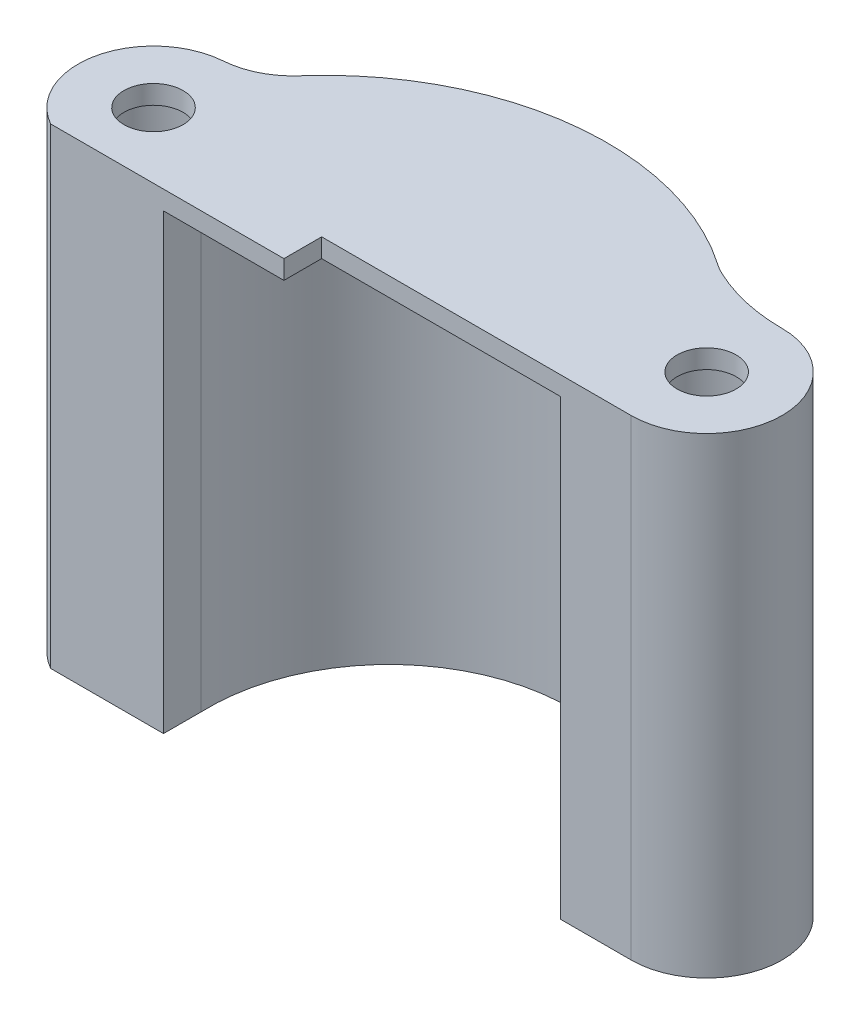
ISO-10303-21;
HEADER;
FILE_DESCRIPTION(('STEP AP214'),'2;1');
FILE_NAME('part.step','',(''),(''),'','','');
FILE_SCHEMA(('AUTOMOTIVE_DESIGN { 1 0 10303 214 1 1 1 1 }'));
ENDSEC;
DATA;
#1=APPLICATION_CONTEXT('core data for automotive mechanical design processes');
#2=APPLICATION_PROTOCOL_DEFINITION('international standard','automotive_design',2000,#1);
#3=PRODUCT_CONTEXT('',#1,'mechanical');
#4=PRODUCT('Part','Part','',(#3));
#5=PRODUCT_RELATED_PRODUCT_CATEGORY('part','',(#4));
#6=PRODUCT_DEFINITION_FORMATION('','',#4);
#7=PRODUCT_DEFINITION_CONTEXT('part definition',#1,'design');
#8=PRODUCT_DEFINITION('design','',#6,#7);
#9=PRODUCT_DEFINITION_SHAPE('','',#8);
#10=(LENGTH_UNIT() NAMED_UNIT(*) SI_UNIT(.MILLI.,.METRE.));
#11=(NAMED_UNIT(*) PLANE_ANGLE_UNIT() SI_UNIT($,.RADIAN.));
#12=(NAMED_UNIT(*) SI_UNIT($,.STERADIAN.) SOLID_ANGLE_UNIT());
#13=UNCERTAINTY_MEASURE_WITH_UNIT(LENGTH_MEASURE(1.E-05),#10,'distance_accuracy_value','');
#14=(GEOMETRIC_REPRESENTATION_CONTEXT(3) GLOBAL_UNCERTAINTY_ASSIGNED_CONTEXT((#13)) GLOBAL_UNIT_ASSIGNED_CONTEXT((#10,
#11,#12)) REPRESENTATION_CONTEXT('',''));
#15=CARTESIAN_POINT('',(0.,0.,0.));
#16=DIRECTION('',(0.,0.,1.));
#17=DIRECTION('',(1.,0.,0.));
#18=AXIS2_PLACEMENT_3D('',#15,#16,#17);
#19=CARTESIAN_POINT('',(-13.6378226737925,38.1,0.));
#20=DIRECTION('',(-1.,0.,0.));
#21=DIRECTION('',(0.,0.,1.));
#22=AXIS2_PLACEMENT_3D('',#19,#20,#21);
#23=PLANE('',#22);
#24=DIRECTION('',(0.,0.,1.));
#25=VECTOR('',#24,1.);
#26=CARTESIAN_POINT('',(-13.6378226737925,38.1,0.));
#27=LINE('',#26,#25);
#28=CARTESIAN_POINT('',(-13.6378226737925,38.1,15.7404965999173));
#29=VERTEX_POINT('',#28);
#30=CARTESIAN_POINT('',(-13.6378226737925,38.1,18.9154965999173));
#31=VERTEX_POINT('',#30);
#32=EDGE_CURVE('E139',#29,#31,#27,.T.);
#33=ORIENTED_EDGE('',*,*,#32,.T.);
#34=DIRECTION('',(0.,-1.,0.));
#35=VECTOR('',#34,1.);
#36=CARTESIAN_POINT('',(-13.6378226737925,38.1,18.9154965999173));
#37=LINE('',#36,#35);
#38=CARTESIAN_POINT('',(-13.6378226737925,0.,18.9154965999173));
#39=VERTEX_POINT('',#38);
#40=EDGE_CURVE('E151',#31,#39,#37,.T.);
#41=ORIENTED_EDGE('',*,*,#40,.T.);
#42=DIRECTION('',(0.,0.,-1.));
#43=VECTOR('',#42,1.);
#44=CARTESIAN_POINT('',(-13.6378226737925,0.,0.));
#45=LINE('',#44,#43);
#46=CARTESIAN_POINT('',(-13.6378226737925,0.,15.7404965999173));
#47=VERTEX_POINT('',#46);
#48=EDGE_CURVE('E245',#39,#47,#45,.T.);
#49=ORIENTED_EDGE('',*,*,#48,.T.);
#50=DIRECTION('',(0.,-1.,0.));
#51=VECTOR('',#50,1.);
#52=CARTESIAN_POINT('',(-13.6378226737925,38.1,15.7404965999173));
#53=LINE('',#52,#51);
#54=EDGE_CURVE('E154',#29,#47,#53,.T.);
#55=ORIENTED_EDGE('',*,*,#54,.F.);
#56=EDGE_LOOP('',(#33,#41,#49,#55));
#57=FACE_BOUND('',#56,.T.);
#58=ADVANCED_FACE('F40',(#57),#23,.F.);
#59=CARTESIAN_POINT('',(0.,38.1,15.7404965999173));
#60=DIRECTION('',(0.,0.,-1.));
#61=DIRECTION('',(-1.,0.,0.));
#62=AXIS2_PLACEMENT_3D('',#59,#60,#61);
#63=PLANE('',#62);
#64=DIRECTION('',(0.,1.,0.));
#65=VECTOR('',#64,1.);
#66=CARTESIAN_POINT('',(-3.50380748671772,17.7380475663924,15.7404965999173));
#67=LINE('',#66,#65);
#68=CARTESIAN_POINT('',(-3.50380748671772,38.1,15.7404965999173));
#69=VERTEX_POINT('',#68);
#70=CARTESIAN_POINT('',(-3.50380748671772,39.6875,15.7404965999173));
#71=VERTEX_POINT('',#70);
#72=EDGE_CURVE('E331',#69,#71,#67,.T.);
#73=ORIENTED_EDGE('',*,*,#72,.F.);
#74=DIRECTION('',(1.,0.,0.));
#75=VECTOR('',#74,1.);
#76=CARTESIAN_POINT('',(-13.6378226737925,38.1,15.7404965999173));
#77=LINE('',#76,#75);
#78=CARTESIAN_POINT('',(16.6090859378619,38.1,15.7404965999173));
#79=VERTEX_POINT('',#78);
#80=EDGE_CURVE('E225',#69,#79,#77,.T.);
#81=ORIENTED_EDGE('',*,*,#80,.T.);
#82=DIRECTION('',(0.,-1.,0.));
#83=VECTOR('',#82,1.);
#84=CARTESIAN_POINT('',(16.6090859378619,38.1,15.7404965999173));
#85=LINE('',#84,#83);
#86=CARTESIAN_POINT('',(16.6090859378619,0.,15.7404965999173));
#87=VERTEX_POINT('',#86);
#88=EDGE_CURVE('E279',#79,#87,#85,.T.);
#89=ORIENTED_EDGE('',*,*,#88,.T.);
#90=DIRECTION('',(1.,0.,0.));
#91=VECTOR('',#90,1.);
#92=CARTESIAN_POINT('',(0.,0.,15.7404965999173));
#93=LINE('',#92,#91);
#94=CARTESIAN_POINT('',(22.5456913931761,0.,15.7404965999173));
#95=VERTEX_POINT('',#94);
#96=EDGE_CURVE('E255',#87,#95,#93,.T.);
#97=ORIENTED_EDGE('',*,*,#96,.T.);
#98=DIRECTION('',(0.,-1.,0.));
#99=VECTOR('',#98,1.);
#100=CARTESIAN_POINT('',(22.5456913931761,38.1,15.7404965999173));
#101=LINE('',#100,#99);
#102=CARTESIAN_POINT('',(22.5456913931761,39.6875,15.7404965999173));
#103=VERTEX_POINT('',#102);
#104=EDGE_CURVE('E275',#103,#95,#101,.T.);
#105=ORIENTED_EDGE('',*,*,#104,.F.);
#106=DIRECTION('',(1.,0.,0.));
#107=VECTOR('',#106,1.);
#108=CARTESIAN_POINT('',(16.6090859378619,39.6875,15.7404965999173));
#109=LINE('',#108,#107);
#110=EDGE_CURVE('E228',#71,#103,#109,.T.);
#111=ORIENTED_EDGE('',*,*,#110,.F.);
#112=EDGE_LOOP('',(#73,#81,#89,#97,#105,#111));
#113=FACE_BOUND('',#112,.T.);
#114=ADVANCED_FACE('F297',(#113),#63,.F.);
#115=CARTESIAN_POINT('',(16.6090859378619,38.1,0.));
#116=DIRECTION('',(1.,0.,0.));
#117=DIRECTION('',(0.,0.,-1.));
#118=AXIS2_PLACEMENT_3D('',#115,#116,#117);
#119=PLANE('',#118);
#120=DIRECTION('',(0.,0.,-1.));
#121=VECTOR('',#120,1.);
#122=CARTESIAN_POINT('',(16.6090859378619,38.1,0.));
#123=LINE('',#122,#121);
#124=CARTESIAN_POINT('',(16.6090859378619,38.1,12.5654965999173));
#125=VERTEX_POINT('',#124);
#126=EDGE_CURVE('E147',#79,#125,#123,.T.);
#127=ORIENTED_EDGE('',*,*,#126,.T.);
#128=DIRECTION('',(0.,-1.,0.));
#129=VECTOR('',#128,1.);
#130=CARTESIAN_POINT('',(16.6090859378619,38.1,12.5654965999173));
#131=LINE('',#130,#129);
#132=CARTESIAN_POINT('',(16.6090859378619,0.,12.5654965999173));
#133=VERTEX_POINT('',#132);
#134=EDGE_CURVE('E171',#125,#133,#131,.T.);
#135=ORIENTED_EDGE('',*,*,#134,.T.);
#136=DIRECTION('',(0.,0.,1.));
#137=VECTOR('',#136,1.);
#138=CARTESIAN_POINT('',(16.6090859378619,0.,0.));
#139=LINE('',#138,#137);
#140=EDGE_CURVE('E251',#133,#87,#139,.T.);
#141=ORIENTED_EDGE('',*,*,#140,.T.);
#142=ORIENTED_EDGE('',*,*,#88,.F.);
#143=EDGE_LOOP('',(#127,#135,#141,#142));
#144=FACE_BOUND('',#143,.T.);
#145=ADVANCED_FACE('F286',(#144),#119,.F.);
#146=CARTESIAN_POINT('',(1.66297527786936,38.1,20.6134230140809));
#147=DIRECTION('',(0.,-1.,0.));
#148=DIRECTION('',(0.,0.,-1.));
#149=AXIS2_PLACEMENT_3D('',#146,#147,#148);
#150=CYLINDRICAL_SURFACE('',#149,23.746023500555);
#151=CARTESIAN_POINT('',(1.66297527786936,39.6875,20.6134230140809));
#152=DIRECTION('',(0.,1.,0.));
#153=DIRECTION('',(0.,0.,1.));
#154=AXIS2_PLACEMENT_3D('',#151,#152,#153);
#155=CIRCLE('',#154,23.746023500555);
#156=CARTESIAN_POINT('',(15.1487765830653,39.6875,1.06842889165444));
#157=VERTEX_POINT('',#156);
#158=CARTESIAN_POINT('',(-16.1639042572107,39.6875,4.92661332789374));
#159=VERTEX_POINT('',#158);
#160=EDGE_CURVE('E215',#157,#159,#155,.T.);
#161=ORIENTED_EDGE('',*,*,#160,.F.);
#162=DIRECTION('',(0.,-1.,0.));
#163=VECTOR('',#162,1.);
#164=CARTESIAN_POINT('',(15.1487765830653,38.1,1.06842889165443));
#165=LINE('',#164,#163);
#166=CARTESIAN_POINT('',(15.1487765830653,0.,1.06842889165443));
#167=VERTEX_POINT('',#166);
#168=EDGE_CURVE('E177',#157,#167,#165,.T.);
#169=ORIENTED_EDGE('',*,*,#168,.T.);
#170=CARTESIAN_POINT('',(1.66297527786936,0.,20.6134230140809));
#171=DIRECTION('',(0.,1.,0.));
#172=DIRECTION('',(0.,0.,1.));
#173=AXIS2_PLACEMENT_3D('',#170,#171,#172);
#174=CIRCLE('',#173,23.746023500555);
#175=CARTESIAN_POINT('',(-16.1639042572107,0.,4.92661332789373));
#176=VERTEX_POINT('',#175);
#177=EDGE_CURVE('E199',#176,#167,#174,.F.);
#178=ORIENTED_EDGE('',*,*,#177,.F.);
#179=DIRECTION('',(0.,-1.,0.));
#180=VECTOR('',#179,1.);
#181=CARTESIAN_POINT('',(-16.1639042572107,38.1,4.92661332789373));
#182=LINE('',#181,#180);
#183=EDGE_CURVE('E169',#176,#159,#182,.F.);
#184=ORIENTED_EDGE('',*,*,#183,.T.);
#185=EDGE_LOOP('',(#161,#169,#178,#184));
#186=FACE_BOUND('',#185,.T.);
#187=ADVANCED_FACE('F203',(#186),#150,.T.);
#188=CARTESIAN_POINT('',(-19.9966884261341,38.1,13.3973356971205));
#189=DIRECTION('',(0.,-1.,0.));
#190=DIRECTION('',(0.,0.,-1.));
#191=AXIS2_PLACEMENT_3D('',#188,#189,#190);
#192=CYLINDRICAL_SURFACE('',#191,6.35);
#193=CARTESIAN_POINT('',(-19.9966884261341,39.6875,13.3973356971205));
#194=DIRECTION('',(0.,1.,0.));
#195=DIRECTION('',(0.,0.,1.));
#196=AXIS2_PLACEMENT_3D('',#193,#194,#195);
#197=CIRCLE('',#196,6.35);
#198=CARTESIAN_POINT('',(-20.4638677435349,39.6875,7.06454456797428));
#199=VERTEX_POINT('',#198);
#200=CARTESIAN_POINT('',(-23.1387260215241,39.6875,18.9154965999173));
#201=VERTEX_POINT('',#200);
#202=EDGE_CURVE('E211',#199,#201,#197,.T.);
#203=ORIENTED_EDGE('',*,*,#202,.F.);
#204=DIRECTION('',(0.,-1.,0.));
#205=VECTOR('',#204,1.);
#206=CARTESIAN_POINT('',(-20.4638677435349,38.1,7.06454456797428));
#207=LINE('',#206,#205);
#208=CARTESIAN_POINT('',(-20.4638677435349,0.,7.06454456797428));
#209=VERTEX_POINT('',#208);
#210=EDGE_CURVE('E184',#199,#209,#207,.T.);
#211=ORIENTED_EDGE('',*,*,#210,.T.);
#212=CARTESIAN_POINT('',(-19.9966884261341,0.,13.3973356971205));
#213=DIRECTION('',(0.,1.,0.));
#214=DIRECTION('',(0.,0.,1.));
#215=AXIS2_PLACEMENT_3D('',#212,#213,#214);
#216=CIRCLE('',#215,6.35);
#217=CARTESIAN_POINT('',(-23.1387260215241,0.,18.9154965999173));
#218=VERTEX_POINT('',#217);
#219=EDGE_CURVE('E200',#209,#218,#216,.T.);
#220=ORIENTED_EDGE('',*,*,#219,.T.);
#221=DIRECTION('',(0.,-1.,0.));
#222=VECTOR('',#221,1.);
#223=CARTESIAN_POINT('',(-23.1387260215241,38.1,18.9154965999173));
#224=LINE('',#223,#222);
#225=EDGE_CURVE('E165',#201,#218,#224,.T.);
#226=ORIENTED_EDGE('',*,*,#225,.F.);
#227=EDGE_LOOP('',(#203,#211,#220,#226));
#228=FACE_BOUND('',#227,.T.);
#229=ADVANCED_FACE('F209',(#228),#192,.T.);
#230=CARTESIAN_POINT('',(0.,38.1,18.9154965999173));
#231=DIRECTION('',(0.,0.,-1.));
#232=DIRECTION('',(-1.,0.,0.));
#233=AXIS2_PLACEMENT_3D('',#230,#231,#232);
#234=PLANE('',#233);
#235=DIRECTION('',(1.,0.,0.));
#236=VECTOR('',#235,1.);
#237=CARTESIAN_POINT('',(0.,0.,18.9154965999173));
#238=LINE('',#237,#236);
#239=EDGE_CURVE('E162',#218,#39,#238,.T.);
#240=ORIENTED_EDGE('',*,*,#239,.T.);
#241=ORIENTED_EDGE('',*,*,#40,.F.);
#242=DIRECTION('',(-1.,0.,0.));
#243=VECTOR('',#242,1.);
#244=CARTESIAN_POINT('',(0.,38.1,18.9154965999173));
#245=LINE('',#244,#243);
#246=CARTESIAN_POINT('',(-3.50380748671772,38.1,18.9154965999173));
#247=VERTEX_POINT('',#246);
#248=EDGE_CURVE('E134',#247,#31,#245,.T.);
#249=ORIENTED_EDGE('',*,*,#248,.F.);
#250=DIRECTION('',(0.,1.,0.));
#251=VECTOR('',#250,1.);
#252=CARTESIAN_POINT('',(-3.50380748671772,17.7380475663924,18.9154965999173));
#253=LINE('',#252,#251);
#254=CARTESIAN_POINT('',(-3.50380748671772,39.6875,18.9154965999173));
#255=VERTEX_POINT('',#254);
#256=EDGE_CURVE('E157',#247,#255,#253,.T.);
#257=ORIENTED_EDGE('',*,*,#256,.T.);
#258=DIRECTION('',(1.,0.,0.));
#259=VECTOR('',#258,1.);
#260=CARTESIAN_POINT('',(-23.1387260215241,39.6875,18.9154965999173));
#261=LINE('',#260,#259);
#262=EDGE_CURVE('E214',#201,#255,#261,.T.);
#263=ORIENTED_EDGE('',*,*,#262,.F.);
#264=ORIENTED_EDGE('',*,*,#225,.T.);
#265=EDGE_LOOP('',(#240,#241,#249,#257,#263,#264));
#266=FACE_BOUND('',#265,.T.);
#267=ADVANCED_FACE('F159',(#266),#234,.F.);
#268=CARTESIAN_POINT('',(1.59099250923585,38.1,15.1567259932861));
#269=DIRECTION('',(0.,-1.,0.));
#270=DIRECTION('',(0.,0.,-1.));
#271=AXIS2_PLACEMENT_3D('',#268,#269,#270);
#272=CYLINDRICAL_SURFACE('',#271,15.24);
#273=CARTESIAN_POINT('',(1.59099250923585,0.,15.1567259932861));
#274=DIRECTION('',(0.,1.,0.));
#275=DIRECTION('',(0.,0.,1.));
#276=AXIS2_PLACEMENT_3D('',#273,#274,#275);
#277=CIRCLE('',#276,15.24);
#278=EDGE_CURVE('E248',#47,#133,#277,.F.);
#279=ORIENTED_EDGE('',*,*,#278,.T.);
#280=ORIENTED_EDGE('',*,*,#134,.F.);
#281=CARTESIAN_POINT('',(1.59099250923585,38.1,15.1567259932861));
#282=DIRECTION('',(0.,1.,0.));
#283=DIRECTION('',(0.,0.,1.));
#284=AXIS2_PLACEMENT_3D('',#281,#282,#283);
#285=CIRCLE('',#284,15.24);
#286=EDGE_CURVE('E230',#29,#125,#285,.F.);
#287=ORIENTED_EDGE('',*,*,#286,.F.);
#288=ORIENTED_EDGE('',*,*,#54,.T.);
#289=EDGE_LOOP('',(#279,#280,#287,#288));
#290=FACE_BOUND('',#289,.T.);
#291=ADVANCED_FACE('F343',(#290),#272,.F.);
#292=CARTESIAN_POINT('',(22.545691393176,38.1,9.39049659991733));
#293=DIRECTION('',(0.,-1.,0.));
#294=DIRECTION('',(0.,0.,-1.));
#295=AXIS2_PLACEMENT_3D('',#292,#293,#294);
#296=CYLINDRICAL_SURFACE('',#295,6.35);
#297=CARTESIAN_POINT('',(22.545691393176,0.,9.39049659991733));
#298=DIRECTION('',(0.,1.,0.));
#299=DIRECTION('',(0.,0.,1.));
#300=AXIS2_PLACEMENT_3D('',#297,#298,#299);
#301=CIRCLE('',#300,6.35);
#302=CARTESIAN_POINT('',(22.545691393176,0.,3.04049659991733));
#303=VERTEX_POINT('',#302);
#304=EDGE_CURVE('E258',#95,#303,#301,.T.);
#305=ORIENTED_EDGE('',*,*,#304,.T.);
#306=DIRECTION('',(0.,-1.,0.));
#307=VECTOR('',#306,1.);
#308=CARTESIAN_POINT('',(22.545691393176,38.1,3.04049659991733));
#309=LINE('',#308,#307);
#310=CARTESIAN_POINT('',(22.545691393176,39.6875,3.04049659991733));
#311=VERTEX_POINT('',#310);
#312=EDGE_CURVE('E233',#311,#303,#309,.T.);
#313=ORIENTED_EDGE('',*,*,#312,.F.);
#314=CARTESIAN_POINT('',(22.545691393176,39.6875,9.39049659991733));
#315=DIRECTION('',(0.,1.,0.));
#316=DIRECTION('',(0.,0.,1.));
#317=AXIS2_PLACEMENT_3D('',#314,#315,#316);
#318=CIRCLE('',#317,6.35);
#319=EDGE_CURVE('E303',#103,#311,#318,.T.);
#320=ORIENTED_EDGE('',*,*,#319,.F.);
#321=ORIENTED_EDGE('',*,*,#104,.T.);
#322=EDGE_LOOP('',(#305,#313,#320,#321));
#323=FACE_BOUND('',#322,.T.);
#324=ADVANCED_FACE('F301',(#323),#296,.T.);
#325=CARTESIAN_POINT('',(22.545691393176,38.1,9.39049659991733));
#326=DIRECTION('',(0.,-1.,0.));
#327=DIRECTION('',(0.,0.,-1.));
#328=AXIS2_PLACEMENT_3D('',#325,#326,#327);
#329=CYLINDRICAL_SURFACE('',#328,4.7625);
#330=CARTESIAN_POINT('',(22.545691393176,38.1,9.39049659991733));
#331=DIRECTION('',(0.,1.,0.));
#332=DIRECTION('',(0.,0.,1.));
#333=AXIS2_PLACEMENT_3D('',#330,#331,#332);
#334=CIRCLE('',#333,4.7625);
#335=CARTESIAN_POINT('',(22.545691393176,38.1,14.1529965999173));
#336=VERTEX_POINT('',#335);
#337=EDGE_CURVE('E206',#336,#336,#334,.T.);
#338=ORIENTED_EDGE('',*,*,#337,.T.);
#339=EDGE_LOOP('',(#338));
#340=FACE_BOUND('',#339,.T.);
#341=CARTESIAN_POINT('',(22.545691393176,0.,9.39049659991733));
#342=DIRECTION('',(0.,1.,0.));
#343=DIRECTION('',(0.,0.,1.));
#344=AXIS2_PLACEMENT_3D('',#341,#342,#343);
#345=CIRCLE('',#344,4.7625);
#346=CARTESIAN_POINT('',(22.545691393176,0.,14.1529965999173));
#347=VERTEX_POINT('',#346);
#348=EDGE_CURVE('E265',#347,#347,#345,.T.);
#349=ORIENTED_EDGE('',*,*,#348,.F.);
#350=EDGE_LOOP('',(#349));
#351=FACE_BOUND('',#350,.T.);
#352=ADVANCED_FACE('F350',(#340,#351),#329,.F.);
#353=CARTESIAN_POINT('',(22.545691393176,38.1,-12.1995034000827));
#354=DIRECTION('',(0.,-1.,0.));
#355=DIRECTION('',(0.,0.,-1.));
#356=AXIS2_PLACEMENT_3D('',#353,#354,#355);
#357=CYLINDRICAL_SURFACE('',#356,15.24);
#358=CARTESIAN_POINT('',(22.545691393176,0.,-12.1995034000827));
#359=DIRECTION('',(0.,1.,0.));
#360=DIRECTION('',(0.,0.,1.));
#361=AXIS2_PLACEMENT_3D('',#358,#359,#360);
#362=CIRCLE('',#361,15.24);
#363=CARTESIAN_POINT('',(16.0474623590527,0.,1.58565599036608));
#364=VERTEX_POINT('',#363);
#365=EDGE_CURVE('E261',#303,#364,#362,.F.);
#366=ORIENTED_EDGE('',*,*,#365,.T.);
#367=DIRECTION('',(0.,-1.,0.));
#368=VECTOR('',#367,1.);
#369=CARTESIAN_POINT('',(16.0474623590527,38.1,1.58565599036608));
#370=LINE('',#369,#368);
#371=CARTESIAN_POINT('',(16.0474623590527,39.6875,1.58565599036608));
#372=VERTEX_POINT('',#371);
#373=EDGE_CURVE('E181',#364,#372,#370,.F.);
#374=ORIENTED_EDGE('',*,*,#373,.T.);
#375=CARTESIAN_POINT('',(22.545691393176,39.6875,-12.1995034000827));
#376=DIRECTION('',(0.,-1.,0.));
#377=DIRECTION('',(0.,0.,1.));
#378=AXIS2_PLACEMENT_3D('',#375,#376,#377);
#379=CIRCLE('',#378,15.24);
#380=EDGE_CURVE('E221',#311,#372,#379,.T.);
#381=ORIENTED_EDGE('',*,*,#380,.F.);
#382=ORIENTED_EDGE('',*,*,#312,.T.);
#383=EDGE_LOOP('',(#366,#374,#381,#382));
#384=FACE_BOUND('',#383,.T.);
#385=ADVANCED_FACE('F376',(#384),#357,.F.);
#386=CARTESIAN_POINT('',(-19.9966884261341,38.1,13.3973356971205));
#387=DIRECTION('',(0.,-1.,0.));
#388=DIRECTION('',(0.,0.,-1.));
#389=AXIS2_PLACEMENT_3D('',#386,#387,#388);
#390=CYLINDRICAL_SURFACE('',#389,4.7625);
#391=CARTESIAN_POINT('',(-19.9966884261341,38.1,13.3973356971205));
#392=DIRECTION('',(0.,1.,0.));
#393=DIRECTION('',(0.,0.,1.));
#394=AXIS2_PLACEMENT_3D('',#391,#392,#393);
#395=CIRCLE('',#394,4.7625);
#396=CARTESIAN_POINT('',(-19.9966884261341,38.1,18.1598356971205));
#397=VERTEX_POINT('',#396);
#398=EDGE_CURVE('E219',#397,#397,#395,.T.);
#399=ORIENTED_EDGE('',*,*,#398,.T.);
#400=EDGE_LOOP('',(#399));
#401=FACE_BOUND('',#400,.T.);
#402=CARTESIAN_POINT('',(-19.9966884261341,0.,13.3973356971205));
#403=DIRECTION('',(0.,1.,0.));
#404=DIRECTION('',(0.,0.,1.));
#405=AXIS2_PLACEMENT_3D('',#402,#403,#404);
#406=CIRCLE('',#405,4.7625);
#407=CARTESIAN_POINT('',(-19.9966884261341,0.,18.1598356971205));
#408=VERTEX_POINT('',#407);
#409=EDGE_CURVE('E234',#408,#408,#406,.T.);
#410=ORIENTED_EDGE('',*,*,#409,.F.);
#411=EDGE_LOOP('',(#410));
#412=FACE_BOUND('',#411,.T.);
#413=ADVANCED_FACE('F378',(#401,#412),#390,.F.);
#414=CARTESIAN_POINT('',(0.,0.,0.));
#415=DIRECTION('',(0.,1.,0.));
#416=DIRECTION('',(0.,0.,1.));
#417=AXIS2_PLACEMENT_3D('',#414,#415,#416);
#418=PLANE('',#417);
#419=ORIENTED_EDGE('',*,*,#219,.F.);
#420=CARTESIAN_POINT('',(-20.9310470609358,0.,0.731753438828078));
#421=DIRECTION('',(0.,1.,0.));
#422=DIRECTION('',(0.,0.,1.));
#423=AXIS2_PLACEMENT_3D('',#420,#421,#422);
#424=CIRCLE('',#423,6.35);
#425=EDGE_CURVE('E49',#209,#176,#424,.T.);
#426=ORIENTED_EDGE('',*,*,#425,.T.);
#427=ORIENTED_EDGE('',*,*,#177,.T.);
#428=CARTESIAN_POINT('',(18.7550577899374,0.,-4.1581604223209));
#429=DIRECTION('',(0.,1.,0.));
#430=DIRECTION('',(0.,0.,1.));
#431=AXIS2_PLACEMENT_3D('',#428,#429,#430);
#432=CIRCLE('',#431,6.35);
#433=EDGE_CURVE('E187',#167,#364,#432,.T.);
#434=ORIENTED_EDGE('',*,*,#433,.T.);
#435=ORIENTED_EDGE('',*,*,#365,.F.);
#436=ORIENTED_EDGE('',*,*,#304,.F.);
#437=ORIENTED_EDGE('',*,*,#96,.F.);
#438=ORIENTED_EDGE('',*,*,#140,.F.);
#439=ORIENTED_EDGE('',*,*,#278,.F.);
#440=ORIENTED_EDGE('',*,*,#48,.F.);
#441=ORIENTED_EDGE('',*,*,#239,.F.);
#442=EDGE_LOOP('',(#419,#426,#427,#434,#435,#436,#437,#438,#439,#440,#441));
#443=FACE_BOUND('',#442,.T.);
#444=ORIENTED_EDGE('',*,*,#348,.T.);
#445=EDGE_LOOP('',(#444));
#446=FACE_BOUND('',#445,.T.);
#447=ORIENTED_EDGE('',*,*,#409,.T.);
#448=EDGE_LOOP('',(#447));
#449=FACE_BOUND('',#448,.T.);
#450=ADVANCED_FACE('F197',(#443,#446,#449),#418,.F.);
#451=CARTESIAN_POINT('',(22.545691393176,38.1,9.39049659991733));
#452=DIRECTION('',(0.,1.,0.));
#453=DIRECTION('',(0.,0.,1.));
#454=AXIS2_PLACEMENT_3D('',#451,#452,#453);
#455=PLANE('',#454);
#456=ORIENTED_EDGE('',*,*,#80,.F.);
#457=DIRECTION('',(0.,0.,-1.));
#458=VECTOR('',#457,1.);
#459=CARTESIAN_POINT('',(-3.50380748671772,38.1,0.));
#460=LINE('',#459,#458);
#461=EDGE_CURVE('E141',#247,#69,#460,.T.);
#462=ORIENTED_EDGE('',*,*,#461,.F.);
#463=ORIENTED_EDGE('',*,*,#248,.T.);
#464=ORIENTED_EDGE('',*,*,#32,.F.);
#465=ORIENTED_EDGE('',*,*,#286,.T.);
#466=ORIENTED_EDGE('',*,*,#126,.F.);
#467=EDGE_LOOP('',(#456,#462,#463,#464,#465,#466));
#468=FACE_BOUND('',#467,.T.);
#469=ADVANCED_FACE('F137',(#468),#455,.F.);
#470=ORIENTED_EDGE('',*,*,#337,.F.);
#471=EDGE_LOOP('',(#470));
#472=FACE_BOUND('',#471,.T.);
#473=CARTESIAN_POINT('',(22.545691393176,38.1,9.39049659991733));
#474=DIRECTION('',(0.,1.,0.));
#475=DIRECTION('',(0.,0.,1.));
#476=AXIS2_PLACEMENT_3D('',#473,#474,#475);
#477=CIRCLE('',#476,2.4892);
#478=CARTESIAN_POINT('',(22.545691393176,38.1,11.8796965999173));
#479=VERTEX_POINT('',#478);
#480=EDGE_CURVE('E312',#479,#479,#477,.T.);
#481=ORIENTED_EDGE('',*,*,#480,.T.);
#482=EDGE_LOOP('',(#481));
#483=FACE_BOUND('',#482,.T.);
#484=ADVANCED_FACE('F423',(#472,#483),#455,.F.);
#485=CARTESIAN_POINT('',(22.545691393176,39.6875,9.39049659991733));
#486=DIRECTION('',(0.,1.,0.));
#487=DIRECTION('',(0.,0.,1.));
#488=AXIS2_PLACEMENT_3D('',#485,#486,#487);
#489=PLANE('',#488);
#490=DIRECTION('',(0.,0.,1.));
#491=VECTOR('',#490,1.);
#492=CARTESIAN_POINT('',(-3.50380748671772,39.6875,0.));
#493=LINE('',#492,#491);
#494=EDGE_CURVE('E148',#71,#255,#493,.T.);
#495=ORIENTED_EDGE('',*,*,#494,.F.);
#496=ORIENTED_EDGE('',*,*,#110,.T.);
#497=ORIENTED_EDGE('',*,*,#319,.T.);
#498=ORIENTED_EDGE('',*,*,#380,.T.);
#499=CARTESIAN_POINT('',(18.7550577899374,39.6875,-4.1581604223209));
#500=DIRECTION('',(0.,1.,0.));
#501=DIRECTION('',(0.,0.,1.));
#502=AXIS2_PLACEMENT_3D('',#499,#500,#501);
#503=CIRCLE('',#502,6.35);
#504=EDGE_CURVE('E190',#372,#157,#503,.F.);
#505=ORIENTED_EDGE('',*,*,#504,.T.);
#506=ORIENTED_EDGE('',*,*,#160,.T.);
#507=CARTESIAN_POINT('',(-20.9310470609358,39.6875,0.731753438828078));
#508=DIRECTION('',(0.,1.,0.));
#509=DIRECTION('',(0.,0.,1.));
#510=AXIS2_PLACEMENT_3D('',#507,#508,#509);
#511=CIRCLE('',#510,6.35);
#512=EDGE_CURVE('E11',#159,#199,#511,.F.);
#513=ORIENTED_EDGE('',*,*,#512,.T.);
#514=ORIENTED_EDGE('',*,*,#202,.T.);
#515=ORIENTED_EDGE('',*,*,#262,.T.);
#516=EDGE_LOOP('',(#495,#496,#497,#498,#505,#506,#513,#514,#515));
#517=FACE_BOUND('',#516,.T.);
#518=CARTESIAN_POINT('',(22.545691393176,39.6875,9.39049659991733));
#519=DIRECTION('',(0.,1.,0.));
#520=DIRECTION('',(0.,0.,1.));
#521=AXIS2_PLACEMENT_3D('',#518,#519,#520);
#522=CIRCLE('',#521,2.4892);
#523=CARTESIAN_POINT('',(22.545691393176,39.6875,11.8796965999173));
#524=VERTEX_POINT('',#523);
#525=EDGE_CURVE('E229',#524,#524,#522,.T.);
#526=ORIENTED_EDGE('',*,*,#525,.F.);
#527=EDGE_LOOP('',(#526));
#528=FACE_BOUND('',#527,.T.);
#529=CARTESIAN_POINT('',(-19.9966884261341,39.6875,13.3973356971205));
#530=DIRECTION('',(0.,1.,0.));
#531=DIRECTION('',(0.,0.,1.));
#532=AXIS2_PLACEMENT_3D('',#529,#530,#531);
#533=CIRCLE('',#532,2.4892);
#534=CARTESIAN_POINT('',(-19.9966884261341,39.6875,15.8865356971205));
#535=VERTEX_POINT('',#534);
#536=EDGE_CURVE('E316',#535,#535,#533,.T.);
#537=ORIENTED_EDGE('',*,*,#536,.F.);
#538=EDGE_LOOP('',(#537));
#539=FACE_BOUND('',#538,.T.);
#540=ADVANCED_FACE('F341',(#517,#528,#539),#489,.T.);
#541=ORIENTED_EDGE('',*,*,#398,.F.);
#542=EDGE_LOOP('',(#541));
#543=FACE_BOUND('',#542,.T.);
#544=CARTESIAN_POINT('',(-19.9966884261341,38.1,13.3973356971205));
#545=DIRECTION('',(0.,1.,0.));
#546=DIRECTION('',(0.,0.,1.));
#547=AXIS2_PLACEMENT_3D('',#544,#545,#546);
#548=CIRCLE('',#547,2.4892);
#549=CARTESIAN_POINT('',(-19.9966884261341,38.1,15.8865356971205));
#550=VERTEX_POINT('',#549);
#551=EDGE_CURVE('E320',#550,#550,#548,.T.);
#552=ORIENTED_EDGE('',*,*,#551,.T.);
#553=EDGE_LOOP('',(#552));
#554=FACE_BOUND('',#553,.T.);
#555=ADVANCED_FACE('F425',(#543,#554),#455,.F.);
#556=CARTESIAN_POINT('',(22.545691393176,39.6875,9.39049659991733));
#557=DIRECTION('',(0.,-1.,0.));
#558=DIRECTION('',(0.,0.,-1.));
#559=AXIS2_PLACEMENT_3D('',#556,#557,#558);
#560=CYLINDRICAL_SURFACE('',#559,2.4892);
#561=ORIENTED_EDGE('',*,*,#525,.T.);
#562=EDGE_LOOP('',(#561));
#563=FACE_BOUND('',#562,.T.);
#564=ORIENTED_EDGE('',*,*,#480,.F.);
#565=EDGE_LOOP('',(#564));
#566=FACE_BOUND('',#565,.T.);
#567=ADVANCED_FACE('F443',(#563,#566),#560,.F.);
#568=CARTESIAN_POINT('',(-19.9966884261341,39.6875,13.3973356971205));
#569=DIRECTION('',(0.,-1.,0.));
#570=DIRECTION('',(0.,0.,-1.));
#571=AXIS2_PLACEMENT_3D('',#568,#569,#570);
#572=CYLINDRICAL_SURFACE('',#571,2.4892);
#573=ORIENTED_EDGE('',*,*,#536,.T.);
#574=EDGE_LOOP('',(#573));
#575=FACE_BOUND('',#574,.T.);
#576=ORIENTED_EDGE('',*,*,#551,.F.);
#577=EDGE_LOOP('',(#576));
#578=FACE_BOUND('',#577,.T.);
#579=ADVANCED_FACE('F371',(#575,#578),#572,.F.);
#580=CARTESIAN_POINT('',(-3.50380748671772,17.7380475663924,0.));
#581=DIRECTION('',(-1.,0.,0.));
#582=DIRECTION('',(0.,0.,1.));
#583=AXIS2_PLACEMENT_3D('',#580,#581,#582);
#584=PLANE('',#583);
#585=ORIENTED_EDGE('',*,*,#256,.F.);
#586=ORIENTED_EDGE('',*,*,#461,.T.);
#587=ORIENTED_EDGE('',*,*,#72,.T.);
#588=ORIENTED_EDGE('',*,*,#494,.T.);
#589=EDGE_LOOP('',(#585,#586,#587,#588));
#590=FACE_BOUND('',#589,.T.);
#591=ADVANCED_FACE('F340',(#590),#584,.F.);
#592=CARTESIAN_POINT('',(18.7550577899374,38.1,-4.1581604223209));
#593=DIRECTION('',(0.,-1.,0.));
#594=DIRECTION('',(0.,0.,-1.));
#595=AXIS2_PLACEMENT_3D('',#592,#593,#594);
#596=CYLINDRICAL_SURFACE('',#595,6.35);
#597=ORIENTED_EDGE('',*,*,#504,.F.);
#598=ORIENTED_EDGE('',*,*,#373,.F.);
#599=ORIENTED_EDGE('',*,*,#433,.F.);
#600=ORIENTED_EDGE('',*,*,#168,.F.);
#601=EDGE_LOOP('',(#597,#598,#599,#600));
#602=FACE_BOUND('',#601,.T.);
#603=ADVANCED_FACE('F364',(#602),#596,.F.);
#604=CARTESIAN_POINT('',(-20.9310470609358,38.1,0.731753438828078));
#605=DIRECTION('',(0.,1.,0.));
#606=DIRECTION('',(0.,0.,1.));
#607=AXIS2_PLACEMENT_3D('',#604,#605,#606);
#608=CYLINDRICAL_SURFACE('',#607,6.35);
#609=ORIENTED_EDGE('',*,*,#512,.F.);
#610=ORIENTED_EDGE('',*,*,#183,.F.);
#611=ORIENTED_EDGE('',*,*,#425,.F.);
#612=ORIENTED_EDGE('',*,*,#210,.F.);
#613=EDGE_LOOP('',(#609,#610,#611,#612));
#614=FACE_BOUND('',#613,.T.);
#615=ADVANCED_FACE('F42',(#614),#608,.F.);
#616=CLOSED_SHELL('',(#58,#114,#145,#187,#229,#267,#291,#324,#352,#385,#413,#450,#469,#484,#540,
#555,#567,#579,#591,#603,#615));
#617=MANIFOLD_SOLID_BREP('B2',#616);
#618=ADVANCED_BREP_SHAPE_REPRESENTATION('',(#18,#617),#14);
#619=SHAPE_DEFINITION_REPRESENTATION(#9,#618);
ENDSEC;
END-ISO-10303-21;
